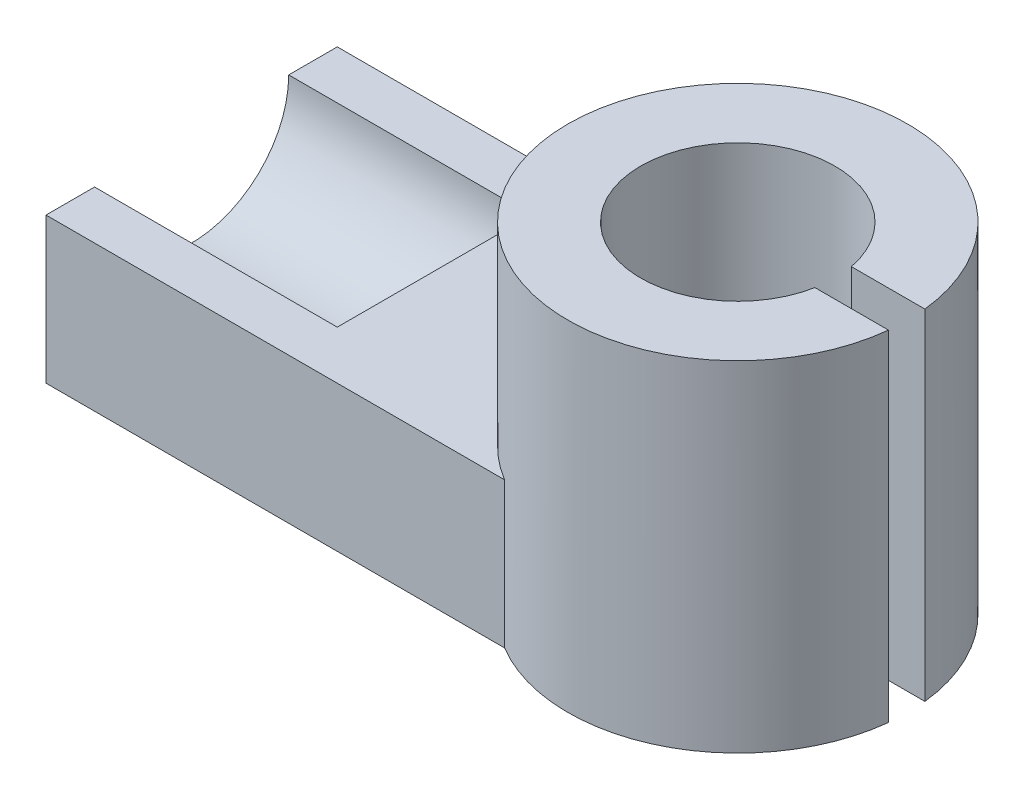
ISO-10303-21;
HEADER;
FILE_DESCRIPTION(('STEP AP214'),'2;1');
FILE_NAME('part.step','',(''),(''),'','','');
FILE_SCHEMA(('AUTOMOTIVE_DESIGN { 1 0 10303 214 1 1 1 1 }'));
ENDSEC;
DATA;
#1=APPLICATION_CONTEXT('core data for automotive mechanical design processes');
#2=APPLICATION_PROTOCOL_DEFINITION('international standard','automotive_design',2000,#1);
#3=PRODUCT_CONTEXT('',#1,'mechanical');
#4=PRODUCT('Part','Part','',(#3));
#5=PRODUCT_RELATED_PRODUCT_CATEGORY('part','',(#4));
#6=PRODUCT_DEFINITION_FORMATION('','',#4);
#7=PRODUCT_DEFINITION_CONTEXT('part definition',#1,'design');
#8=PRODUCT_DEFINITION('design','',#6,#7);
#9=PRODUCT_DEFINITION_SHAPE('','',#8);
#10=(LENGTH_UNIT() NAMED_UNIT(*) SI_UNIT(.MILLI.,.METRE.));
#11=(NAMED_UNIT(*) PLANE_ANGLE_UNIT() SI_UNIT($,.RADIAN.));
#12=(NAMED_UNIT(*) SI_UNIT($,.STERADIAN.) SOLID_ANGLE_UNIT());
#13=UNCERTAINTY_MEASURE_WITH_UNIT(LENGTH_MEASURE(1.E-05),#10,'distance_accuracy_value','');
#14=(GEOMETRIC_REPRESENTATION_CONTEXT(3) GLOBAL_UNCERTAINTY_ASSIGNED_CONTEXT((#13)) GLOBAL_UNIT_ASSIGNED_CONTEXT((#10,
#11,#12)) REPRESENTATION_CONTEXT('',''));
#15=CARTESIAN_POINT('',(0.,0.,0.));
#16=DIRECTION('',(0.,0.,1.));
#17=DIRECTION('',(1.,0.,0.));
#18=AXIS2_PLACEMENT_3D('',#15,#16,#17);
#19=CARTESIAN_POINT('',(0.,56.,0.));
#20=DIRECTION('',(0.,-1.,0.));
#21=DIRECTION('',(0.,0.,-1.));
#22=AXIS2_PLACEMENT_3D('',#19,#20,#21);
#23=CYLINDRICAL_SURFACE('',#22,16.);
#24=CARTESIAN_POINT('',(0.,0.,0.));
#25=DIRECTION('',(0.,1.,0.));
#26=DIRECTION('',(0.,0.,1.));
#27=AXIS2_PLACEMENT_3D('',#24,#25,#26);
#28=CIRCLE('',#27,16.);
#29=CARTESIAN_POINT('',(15.7162336455017,0.,-3.));
#30=VERTEX_POINT('',#29);
#31=CARTESIAN_POINT('',(15.7162336455017,0.,3.));
#32=VERTEX_POINT('',#31);
#33=EDGE_CURVE('E164',#30,#32,#28,.T.);
#34=ORIENTED_EDGE('',*,*,#33,.F.);
#35=DIRECTION('',(0.,-1.,0.));
#36=VECTOR('',#35,1.);
#37=CARTESIAN_POINT('',(15.7162336455017,56.,-3.));
#38=LINE('',#37,#36);
#39=CARTESIAN_POINT('',(15.7162336455017,56.,-3.));
#40=VERTEX_POINT('',#39);
#41=EDGE_CURVE('E193',#40,#30,#38,.T.);
#42=ORIENTED_EDGE('',*,*,#41,.F.);
#43=CARTESIAN_POINT('',(0.,56.,0.));
#44=DIRECTION('',(0.,1.,0.));
#45=DIRECTION('',(0.,0.,1.));
#46=AXIS2_PLACEMENT_3D('',#43,#44,#45);
#47=CIRCLE('',#46,16.);
#48=CARTESIAN_POINT('',(15.7162336455017,56.,3.));
#49=VERTEX_POINT('',#48);
#50=EDGE_CURVE('E165',#40,#49,#47,.T.);
#51=ORIENTED_EDGE('',*,*,#50,.T.);
#52=DIRECTION('',(0.,-1.,0.));
#53=VECTOR('',#52,1.);
#54=CARTESIAN_POINT('',(15.7162336455017,56.,3.));
#55=LINE('',#54,#53);
#56=EDGE_CURVE('E176',#49,#32,#55,.T.);
#57=ORIENTED_EDGE('',*,*,#56,.T.);
#58=EDGE_LOOP('',(#34,#42,#51,#57));
#59=FACE_BOUND('',#58,.T.);
#60=ADVANCED_FACE('F46',(#59),#23,.F.);
#61=CARTESIAN_POINT('',(0.,56.,-3.));
#62=DIRECTION('',(0.,0.,-1.));
#63=DIRECTION('',(-1.,0.,0.));
#64=AXIS2_PLACEMENT_3D('',#61,#62,#63);
#65=PLANE('',#64);
#66=DIRECTION('',(1.,0.,0.));
#67=VECTOR('',#66,1.);
#68=CARTESIAN_POINT('',(0.,0.,-3.));
#69=LINE('',#68,#67);
#70=CARTESIAN_POINT('',(27.8388218141501,0.,-3.));
#71=VERTEX_POINT('',#70);
#72=EDGE_CURVE('E179',#30,#71,#69,.T.);
#73=ORIENTED_EDGE('',*,*,#72,.T.);
#74=DIRECTION('',(0.,-1.,0.));
#75=VECTOR('',#74,1.);
#76=CARTESIAN_POINT('',(27.8388218141501,56.,-3.));
#77=LINE('',#76,#75);
#78=CARTESIAN_POINT('',(27.8388218141501,56.,-3.));
#79=VERTEX_POINT('',#78);
#80=EDGE_CURVE('E190',#79,#71,#77,.T.);
#81=ORIENTED_EDGE('',*,*,#80,.F.);
#82=DIRECTION('',(1.,0.,0.));
#83=VECTOR('',#82,1.);
#84=CARTESIAN_POINT('',(0.,56.,-3.));
#85=LINE('',#84,#83);
#86=EDGE_CURVE('E168',#40,#79,#85,.T.);
#87=ORIENTED_EDGE('',*,*,#86,.F.);
#88=ORIENTED_EDGE('',*,*,#41,.T.);
#89=EDGE_LOOP('',(#73,#81,#87,#88));
#90=FACE_BOUND('',#89,.T.);
#91=ADVANCED_FACE('F198',(#90),#65,.F.);
#92=CARTESIAN_POINT('',(0.,56.,0.));
#93=DIRECTION('',(0.,-1.,0.));
#94=DIRECTION('',(0.,0.,-1.));
#95=AXIS2_PLACEMENT_3D('',#92,#93,#94);
#96=CYLINDRICAL_SURFACE('',#95,28.);
#97=CARTESIAN_POINT('',(0.,0.,0.));
#98=DIRECTION('',(0.,1.,0.));
#99=DIRECTION('',(0.,0.,1.));
#100=AXIS2_PLACEMENT_3D('',#97,#98,#99);
#101=CIRCLE('',#100,28.);
#102=CARTESIAN_POINT('',(-14.422205101856,0.,-24.));
#103=VERTEX_POINT('',#102);
#104=EDGE_CURVE('E182',#71,#103,#101,.T.);
#105=ORIENTED_EDGE('',*,*,#104,.T.);
#106=DIRECTION('',(0.,-1.,0.));
#107=VECTOR('',#106,1.);
#108=CARTESIAN_POINT('',(-14.422205101856,24.,-24.));
#109=LINE('',#108,#107);
#110=CARTESIAN_POINT('',(-14.422205101856,24.,-24.));
#111=VERTEX_POINT('',#110);
#112=EDGE_CURVE('E161',#111,#103,#109,.T.);
#113=ORIENTED_EDGE('',*,*,#112,.F.);
#114=CARTESIAN_POINT('',(0.,24.,0.));
#115=DIRECTION('',(0.,1.,0.));
#116=DIRECTION('',(0.,0.,1.));
#117=AXIS2_PLACEMENT_3D('',#114,#115,#116);
#118=CIRCLE('',#117,28.);
#119=CARTESIAN_POINT('',(-14.422205101856,24.,24.));
#120=VERTEX_POINT('',#119);
#121=EDGE_CURVE('E67',#111,#120,#118,.T.);
#122=ORIENTED_EDGE('',*,*,#121,.T.);
#123=DIRECTION('',(0.,-1.,0.));
#124=VECTOR('',#123,1.);
#125=CARTESIAN_POINT('',(-14.422205101856,24.,24.));
#126=LINE('',#125,#124);
#127=CARTESIAN_POINT('',(-14.422205101856,0.,24.));
#128=VERTEX_POINT('',#127);
#129=EDGE_CURVE('E142',#120,#128,#126,.T.);
#130=ORIENTED_EDGE('',*,*,#129,.T.);
#131=CARTESIAN_POINT('',(27.8388218141501,0.,3.));
#132=VERTEX_POINT('',#131);
#133=EDGE_CURVE('E181',#128,#132,#101,.T.);
#134=ORIENTED_EDGE('',*,*,#133,.T.);
#135=DIRECTION('',(0.,-1.,0.));
#136=VECTOR('',#135,1.);
#137=CARTESIAN_POINT('',(27.8388218141501,56.,3.));
#138=LINE('',#137,#136);
#139=CARTESIAN_POINT('',(27.8388218141501,56.,3.));
#140=VERTEX_POINT('',#139);
#141=EDGE_CURVE('E187',#140,#132,#138,.T.);
#142=ORIENTED_EDGE('',*,*,#141,.F.);
#143=CARTESIAN_POINT('',(0.,56.,0.));
#144=DIRECTION('',(0.,1.,0.));
#145=DIRECTION('',(0.,0.,1.));
#146=AXIS2_PLACEMENT_3D('',#143,#144,#145);
#147=CIRCLE('',#146,28.);
#148=EDGE_CURVE('E171',#79,#140,#147,.T.);
#149=ORIENTED_EDGE('',*,*,#148,.F.);
#150=ORIENTED_EDGE('',*,*,#80,.T.);
#151=EDGE_LOOP('',(#105,#113,#122,#130,#134,#142,#149,#150));
#152=FACE_BOUND('',#151,.T.);
#153=ADVANCED_FACE('F213',(#152),#96,.T.);
#154=CARTESIAN_POINT('',(0.,56.,3.));
#155=DIRECTION('',(0.,0.,-1.));
#156=DIRECTION('',(-1.,0.,0.));
#157=AXIS2_PLACEMENT_3D('',#154,#155,#156);
#158=PLANE('',#157);
#159=DIRECTION('',(1.,0.,0.));
#160=VECTOR('',#159,1.);
#161=CARTESIAN_POINT('',(0.,0.,3.));
#162=LINE('',#161,#160);
#163=EDGE_CURVE('E169',#32,#132,#162,.T.);
#164=ORIENTED_EDGE('',*,*,#163,.F.);
#165=ORIENTED_EDGE('',*,*,#56,.F.);
#166=DIRECTION('',(1.,0.,0.));
#167=VECTOR('',#166,1.);
#168=CARTESIAN_POINT('',(0.,56.,3.));
#169=LINE('',#168,#167);
#170=EDGE_CURVE('E173',#49,#140,#169,.T.);
#171=ORIENTED_EDGE('',*,*,#170,.T.);
#172=ORIENTED_EDGE('',*,*,#141,.T.);
#173=EDGE_LOOP('',(#164,#165,#171,#172));
#174=FACE_BOUND('',#173,.T.);
#175=ADVANCED_FACE('F209',(#174),#158,.T.);
#176=CARTESIAN_POINT('',(0.,56.,0.));
#177=DIRECTION('',(0.,1.,0.));
#178=DIRECTION('',(0.,0.,1.));
#179=AXIS2_PLACEMENT_3D('',#176,#177,#178);
#180=PLANE('',#179);
#181=ORIENTED_EDGE('',*,*,#50,.F.);
#182=ORIENTED_EDGE('',*,*,#86,.T.);
#183=ORIENTED_EDGE('',*,*,#148,.T.);
#184=ORIENTED_EDGE('',*,*,#170,.F.);
#185=EDGE_LOOP('',(#181,#182,#183,#184));
#186=FACE_BOUND('',#185,.T.);
#187=ADVANCED_FACE('F224',(#186),#180,.T.);
#188=CARTESIAN_POINT('',(0.,0.,0.));
#189=DIRECTION('',(0.,1.,0.));
#190=DIRECTION('',(0.,0.,1.));
#191=AXIS2_PLACEMENT_3D('',#188,#189,#190);
#192=PLANE('',#191);
#193=ORIENTED_EDGE('',*,*,#33,.T.);
#194=ORIENTED_EDGE('',*,*,#163,.T.);
#195=ORIENTED_EDGE('',*,*,#133,.F.);
#196=DIRECTION('',(1.,0.,0.));
#197=VECTOR('',#196,1.);
#198=CARTESIAN_POINT('',(0.,0.,24.));
#199=LINE('',#198,#197);
#200=CARTESIAN_POINT('',(-89.9999999999999,0.,24.));
#201=VERTEX_POINT('',#200);
#202=EDGE_CURVE('E154',#201,#128,#199,.T.);
#203=ORIENTED_EDGE('',*,*,#202,.F.);
#204=DIRECTION('',(0.,0.,-1.));
#205=VECTOR('',#204,1.);
#206=CARTESIAN_POINT('',(-90.,0.,1.04083408558608E-13));
#207=LINE('',#206,#205);
#208=CARTESIAN_POINT('',(-90.,0.,-24.));
#209=VERTEX_POINT('',#208);
#210=EDGE_CURVE('E151',#201,#209,#207,.T.);
#211=ORIENTED_EDGE('',*,*,#210,.T.);
#212=DIRECTION('',(1.,0.,0.));
#213=VECTOR('',#212,1.);
#214=CARTESIAN_POINT('',(0.,0.,-24.));
#215=LINE('',#214,#213);
#216=EDGE_CURVE('E148',#209,#103,#215,.T.);
#217=ORIENTED_EDGE('',*,*,#216,.T.);
#218=ORIENTED_EDGE('',*,*,#104,.F.);
#219=ORIENTED_EDGE('',*,*,#72,.F.);
#220=EDGE_LOOP('',(#193,#194,#195,#203,#211,#217,#218,#219));
#221=FACE_BOUND('',#220,.T.);
#222=ADVANCED_FACE('F205',(#221),#192,.F.);
#223=CARTESIAN_POINT('',(0.,24.,-24.));
#224=DIRECTION('',(0.,0.,-1.));
#225=DIRECTION('',(-1.,0.,0.));
#226=AXIS2_PLACEMENT_3D('',#223,#224,#225);
#227=PLANE('',#226);
#228=ORIENTED_EDGE('',*,*,#216,.F.);
#229=DIRECTION('',(0.,-1.,0.));
#230=VECTOR('',#229,1.);
#231=CARTESIAN_POINT('',(-90.,24.,-24.));
#232=LINE('',#231,#230);
#233=CARTESIAN_POINT('',(-90.,24.,-24.));
#234=VERTEX_POINT('',#233);
#235=EDGE_CURVE('E159',#234,#209,#232,.T.);
#236=ORIENTED_EDGE('',*,*,#235,.F.);
#237=DIRECTION('',(1.,0.,0.));
#238=VECTOR('',#237,1.);
#239=CARTESIAN_POINT('',(0.,24.,-24.));
#240=LINE('',#239,#238);
#241=EDGE_CURVE('E144',#234,#111,#240,.T.);
#242=ORIENTED_EDGE('',*,*,#241,.T.);
#243=ORIENTED_EDGE('',*,*,#112,.T.);
#244=EDGE_LOOP('',(#228,#236,#242,#243));
#245=FACE_BOUND('',#244,.T.);
#246=ADVANCED_FACE('F221',(#245),#227,.T.);
#247=CARTESIAN_POINT('',(-90.,24.,1.04083408558608E-13));
#248=DIRECTION('',(-1.,0.,0.));
#249=DIRECTION('',(0.,0.,1.));
#250=AXIS2_PLACEMENT_3D('',#247,#248,#249);
#251=PLANE('',#250);
#252=CARTESIAN_POINT('',(-90.,24.,0.));
#253=DIRECTION('',(-1.,0.,0.));
#254=DIRECTION('',(0.,0.,1.));
#255=AXIS2_PLACEMENT_3D('',#252,#253,#254);
#256=CIRCLE('',#255,16.);
#257=CARTESIAN_POINT('',(-90.,24.,-16.));
#258=VERTEX_POINT('',#257);
#259=CARTESIAN_POINT('',(-90.,24.,16.));
#260=VERTEX_POINT('',#259);
#261=EDGE_CURVE('E121',#258,#260,#256,.T.);
#262=ORIENTED_EDGE('',*,*,#261,.F.);
#263=DIRECTION('',(0.,0.,-1.));
#264=VECTOR('',#263,1.);
#265=CARTESIAN_POINT('',(-90.,24.,1.04083408558608E-13));
#266=LINE('',#265,#264);
#267=EDGE_CURVE('E140',#258,#234,#266,.T.);
#268=ORIENTED_EDGE('',*,*,#267,.T.);
#269=ORIENTED_EDGE('',*,*,#235,.T.);
#270=ORIENTED_EDGE('',*,*,#210,.F.);
#271=DIRECTION('',(0.,-1.,0.));
#272=VECTOR('',#271,1.);
#273=CARTESIAN_POINT('',(-89.9999999999999,24.,24.));
#274=LINE('',#273,#272);
#275=CARTESIAN_POINT('',(-89.9999999999999,24.,24.));
#276=VERTEX_POINT('',#275);
#277=EDGE_CURVE('E137',#276,#201,#274,.T.);
#278=ORIENTED_EDGE('',*,*,#277,.F.);
#279=EDGE_CURVE('E133',#276,#260,#266,.T.);
#280=ORIENTED_EDGE('',*,*,#279,.T.);
#281=EDGE_LOOP('',(#262,#268,#269,#270,#278,#280));
#282=FACE_BOUND('',#281,.T.);
#283=ADVANCED_FACE('F135',(#282),#251,.T.);
#284=CARTESIAN_POINT('',(0.,24.,24.));
#285=DIRECTION('',(0.,0.,-1.));
#286=DIRECTION('',(-1.,0.,0.));
#287=AXIS2_PLACEMENT_3D('',#284,#285,#286);
#288=PLANE('',#287);
#289=ORIENTED_EDGE('',*,*,#202,.T.);
#290=ORIENTED_EDGE('',*,*,#129,.F.);
#291=DIRECTION('',(1.,0.,0.));
#292=VECTOR('',#291,1.);
#293=CARTESIAN_POINT('',(0.,24.,24.));
#294=LINE('',#293,#292);
#295=EDGE_CURVE('E139',#276,#120,#294,.T.);
#296=ORIENTED_EDGE('',*,*,#295,.F.);
#297=ORIENTED_EDGE('',*,*,#277,.T.);
#298=EDGE_LOOP('',(#289,#290,#296,#297));
#299=FACE_BOUND('',#298,.T.);
#300=ADVANCED_FACE('F215',(#299),#288,.F.);
#301=CARTESIAN_POINT('',(0.,24.,0.));
#302=DIRECTION('',(0.,1.,0.));
#303=DIRECTION('',(0.,0.,1.));
#304=AXIS2_PLACEMENT_3D('',#301,#302,#303);
#305=PLANE('',#304);
#306=DIRECTION('',(-1.,0.,0.));
#307=VECTOR('',#306,1.);
#308=CARTESIAN_POINT('',(-50.,24.,-16.));
#309=LINE('',#308,#307);
#310=CARTESIAN_POINT('',(-50.,24.,-16.));
#311=VERTEX_POINT('',#310);
#312=EDGE_CURVE('E13',#311,#258,#309,.T.);
#313=ORIENTED_EDGE('',*,*,#312,.F.);
#314=DIRECTION('',(0.,0.,1.));
#315=VECTOR('',#314,1.);
#316=CARTESIAN_POINT('',(-50.,24.,0.));
#317=LINE('',#316,#315);
#318=CARTESIAN_POINT('',(-50.,24.,16.));
#319=VERTEX_POINT('',#318);
#320=EDGE_CURVE('E134',#311,#319,#317,.T.);
#321=ORIENTED_EDGE('',*,*,#320,.T.);
#322=DIRECTION('',(-1.,0.,0.));
#323=VECTOR('',#322,1.);
#324=CARTESIAN_POINT('',(-50.,24.,16.));
#325=LINE('',#324,#323);
#326=EDGE_CURVE('E53',#260,#319,#325,.F.);
#327=ORIENTED_EDGE('',*,*,#326,.F.);
#328=ORIENTED_EDGE('',*,*,#279,.F.);
#329=ORIENTED_EDGE('',*,*,#295,.T.);
#330=ORIENTED_EDGE('',*,*,#121,.F.);
#331=ORIENTED_EDGE('',*,*,#241,.F.);
#332=ORIENTED_EDGE('',*,*,#267,.F.);
#333=EDGE_LOOP('',(#313,#321,#327,#328,#329,#330,#331,#332));
#334=FACE_BOUND('',#333,.T.);
#335=ADVANCED_FACE('F132',(#334),#305,.T.);
#336=CARTESIAN_POINT('',(-50.,24.,0.));
#337=DIRECTION('',(-1.,0.,0.));
#338=DIRECTION('',(0.,0.,1.));
#339=AXIS2_PLACEMENT_3D('',#336,#337,#338);
#340=CYLINDRICAL_SURFACE('',#339,16.);
#341=ORIENTED_EDGE('',*,*,#312,.T.);
#342=ORIENTED_EDGE('',*,*,#261,.T.);
#343=ORIENTED_EDGE('',*,*,#326,.T.);
#344=CARTESIAN_POINT('',(-50.,24.,0.));
#345=DIRECTION('',(-1.,0.,0.));
#346=DIRECTION('',(0.,0.,1.));
#347=AXIS2_PLACEMENT_3D('',#344,#345,#346);
#348=CIRCLE('',#347,16.);
#349=EDGE_CURVE('E59',#311,#319,#348,.T.);
#350=ORIENTED_EDGE('',*,*,#349,.F.);
#351=EDGE_LOOP('',(#341,#342,#343,#350));
#352=FACE_BOUND('',#351,.T.);
#353=ADVANCED_FACE('F123',(#352),#340,.F.);
#354=CARTESIAN_POINT('',(-50.,24.,0.));
#355=DIRECTION('',(-1.,0.,0.));
#356=DIRECTION('',(0.,0.,1.));
#357=AXIS2_PLACEMENT_3D('',#354,#355,#356);
#358=PLANE('',#357);
#359=ORIENTED_EDGE('',*,*,#349,.T.);
#360=ORIENTED_EDGE('',*,*,#320,.F.);
#361=EDGE_LOOP('',(#359,#360));
#362=FACE_BOUND('',#361,.T.);
#363=ADVANCED_FACE('F299',(#362),#358,.T.);
#364=CLOSED_SHELL('',(#60,#91,#153,#175,#187,#222,#246,#283,#300,#335,#353,#363));
#365=MANIFOLD_SOLID_BREP('B2',#364);
#366=ADVANCED_BREP_SHAPE_REPRESENTATION('',(#18,#365),#14);
#367=SHAPE_DEFINITION_REPRESENTATION(#9,#366);
ENDSEC;
END-ISO-10303-21;
